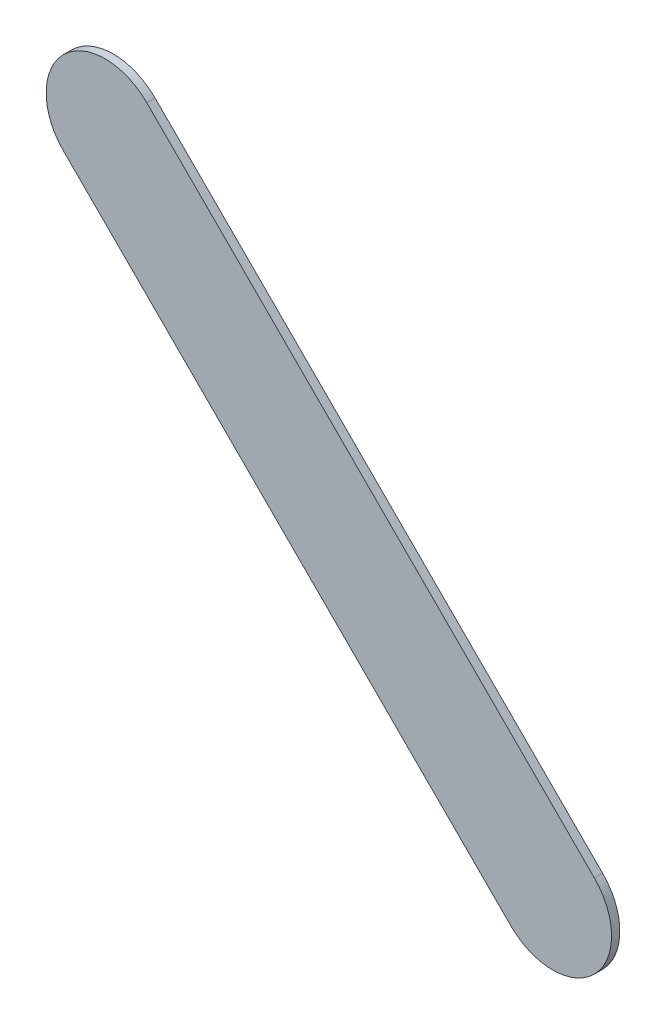
ISO-10303-21;
HEADER;
FILE_DESCRIPTION(('STEP AP214'),'2;1');
FILE_NAME('part.step','',(''),(''),'','','');
FILE_SCHEMA(('AUTOMOTIVE_DESIGN { 1 0 10303 214 1 1 1 1 }'));
ENDSEC;
DATA;
#1=APPLICATION_CONTEXT('core data for automotive mechanical design processes');
#2=APPLICATION_PROTOCOL_DEFINITION('international standard','automotive_design',2000,#1);
#3=PRODUCT_CONTEXT('',#1,'mechanical');
#4=PRODUCT('Part','Part','',(#3));
#5=PRODUCT_RELATED_PRODUCT_CATEGORY('part','',(#4));
#6=PRODUCT_DEFINITION_FORMATION('','',#4);
#7=PRODUCT_DEFINITION_CONTEXT('part definition',#1,'design');
#8=PRODUCT_DEFINITION('design','',#6,#7);
#9=PRODUCT_DEFINITION_SHAPE('','',#8);
#10=(LENGTH_UNIT() NAMED_UNIT(*) SI_UNIT(.MILLI.,.METRE.));
#11=(NAMED_UNIT(*) PLANE_ANGLE_UNIT() SI_UNIT($,.RADIAN.));
#12=(NAMED_UNIT(*) SI_UNIT($,.STERADIAN.) SOLID_ANGLE_UNIT());
#13=UNCERTAINTY_MEASURE_WITH_UNIT(LENGTH_MEASURE(1.E-05),#10,'distance_accuracy_value','');
#14=(GEOMETRIC_REPRESENTATION_CONTEXT(3) GLOBAL_UNCERTAINTY_ASSIGNED_CONTEXT((#13)) GLOBAL_UNIT_ASSIGNED_CONTEXT((#10,
#11,#12)) REPRESENTATION_CONTEXT('',''));
#15=CARTESIAN_POINT('',(0.,0.,0.));
#16=DIRECTION('',(0.,0.,1.));
#17=DIRECTION('',(1.,0.,0.));
#18=AXIS2_PLACEMENT_3D('',#15,#16,#17);
#19=CARTESIAN_POINT('',(149.020776,-72.333242,0.));
#20=DIRECTION('',(0.,0.,1.));
#21=DIRECTION('',(1.,0.,0.));
#22=AXIS2_PLACEMENT_3D('',#19,#20,#21);
#23=PLANE('',#22);
#24=DIRECTION('',(-0.707106781186548,0.707106781186548,0.));
#25=VECTOR('',#24,1.);
#26=CARTESIAN_POINT('',(149.020776,-72.333242,0.));
#27=LINE('',#26,#25);
#28=CARTESIAN_POINT('',(149.020776,-72.333242,0.));
#29=VERTEX_POINT('',#28);
#30=CARTESIAN_POINT('',(147.122757,-70.435223,0.));
#31=VERTEX_POINT('',#30);
#32=EDGE_CURVE('E85',#29,#31,#27,.T.);
#33=ORIENTED_EDGE('',*,*,#32,.T.);
#34=CARTESIAN_POINT('',(146.9459805,-70.6119995,0.));
#35=DIRECTION('',(0.,0.,1.));
#36=DIRECTION('',(0.707106781186548,0.707106781186548,0.));
#37=AXIS2_PLACEMENT_3D('',#34,#35,#36);
#38=CIRCLE('',#37,0.249999723809);
#39=CARTESIAN_POINT('',(146.769204,-70.788776,0.));
#40=VERTEX_POINT('',#39);
#41=EDGE_CURVE('E72',#31,#40,#38,.T.);
#42=ORIENTED_EDGE('',*,*,#41,.T.);
#43=DIRECTION('',(0.707106781186548,-0.707106781186548,0.));
#44=VECTOR('',#43,1.);
#45=CARTESIAN_POINT('',(146.769204,-70.788776,0.));
#46=LINE('',#45,#44);
#47=CARTESIAN_POINT('',(148.667223,-72.686795,0.));
#48=VERTEX_POINT('',#47);
#49=EDGE_CURVE('E108',#40,#48,#46,.T.);
#50=ORIENTED_EDGE('',*,*,#49,.T.);
#51=CARTESIAN_POINT('',(148.8439995,-72.5100185,0.));
#52=DIRECTION('',(0.,0.,1.));
#53=DIRECTION('',(-0.707106781186548,-0.707106781186548,0.));
#54=AXIS2_PLACEMENT_3D('',#51,#52,#53);
#55=CIRCLE('',#54,0.249999723809);
#56=EDGE_CURVE('E11',#48,#29,#55,.T.);
#57=ORIENTED_EDGE('',*,*,#56,.T.);
#58=EDGE_LOOP('',(#33,#42,#50,#57));
#59=FACE_BOUND('',#58,.T.);
#60=ADVANCED_FACE('F17',(#59),#23,.T.);
#61=CARTESIAN_POINT('',(149.020776,-72.333242,-0.035));
#62=DIRECTION('',(0.,0.,1.));
#63=DIRECTION('',(1.,0.,0.));
#64=AXIS2_PLACEMENT_3D('',#61,#62,#63);
#65=PLANE('',#64);
#66=CARTESIAN_POINT('',(148.8439995,-72.5100185,-0.035));
#67=DIRECTION('',(0.,0.,1.));
#68=DIRECTION('',(-0.707106781186548,-0.707106781186548,0.));
#69=AXIS2_PLACEMENT_3D('',#66,#67,#68);
#70=CIRCLE('',#69,0.249999723809);
#71=CARTESIAN_POINT('',(148.667223,-72.686795,-0.035));
#72=VERTEX_POINT('',#71);
#73=CARTESIAN_POINT('',(149.020776,-72.333242,-0.035));
#74=VERTEX_POINT('',#73);
#75=EDGE_CURVE('E26',#72,#74,#70,.T.);
#76=ORIENTED_EDGE('',*,*,#75,.F.);
#77=DIRECTION('',(0.707106781186548,-0.707106781186548,0.));
#78=VECTOR('',#77,1.);
#79=CARTESIAN_POINT('',(146.769204,-70.788776,-0.035));
#80=LINE('',#79,#78);
#81=CARTESIAN_POINT('',(146.769204,-70.788776,-0.035));
#82=VERTEX_POINT('',#81);
#83=EDGE_CURVE('E20',#82,#72,#80,.T.);
#84=ORIENTED_EDGE('',*,*,#83,.F.);
#85=CARTESIAN_POINT('',(146.9459805,-70.6119995,-0.035));
#86=DIRECTION('',(0.,0.,1.));
#87=DIRECTION('',(0.707106781186548,0.707106781186548,0.));
#88=AXIS2_PLACEMENT_3D('',#85,#86,#87);
#89=CIRCLE('',#88,0.249999723809);
#90=CARTESIAN_POINT('',(147.122757,-70.435223,-0.035));
#91=VERTEX_POINT('',#90);
#92=EDGE_CURVE('E103',#91,#82,#89,.T.);
#93=ORIENTED_EDGE('',*,*,#92,.F.);
#94=DIRECTION('',(-0.707106781186548,0.707106781186548,0.));
#95=VECTOR('',#94,1.);
#96=CARTESIAN_POINT('',(149.020776,-72.333242,-0.035));
#97=LINE('',#96,#95);
#98=EDGE_CURVE('E92',#74,#91,#97,.T.);
#99=ORIENTED_EDGE('',*,*,#98,.F.);
#100=EDGE_LOOP('',(#76,#84,#93,#99));
#101=FACE_BOUND('',#100,.T.);
#102=ADVANCED_FACE('F125',(#101),#65,.F.);
#103=CARTESIAN_POINT('',(148.8439995,-72.5100185,-0.035));
#104=DIRECTION('',(0.,0.,-1.));
#105=DIRECTION('',(-0.707106781186548,-0.707106781186548,0.));
#106=AXIS2_PLACEMENT_3D('',#103,#104,#105);
#107=CYLINDRICAL_SURFACE('',#106,0.249999723809);
#108=ORIENTED_EDGE('',*,*,#75,.T.);
#109=DIRECTION('',(0.,0.,1.));
#110=VECTOR('',#109,1.);
#111=CARTESIAN_POINT('',(149.020776,-72.333242,-0.035));
#112=LINE('',#111,#110);
#113=EDGE_CURVE('E89',#74,#29,#112,.T.);
#114=ORIENTED_EDGE('',*,*,#113,.T.);
#115=ORIENTED_EDGE('',*,*,#56,.F.);
#116=DIRECTION('',(0.,0.,1.));
#117=VECTOR('',#116,1.);
#118=CARTESIAN_POINT('',(148.667223,-72.686795,-0.035));
#119=LINE('',#118,#117);
#120=EDGE_CURVE('E110',#72,#48,#119,.T.);
#121=ORIENTED_EDGE('',*,*,#120,.F.);
#122=EDGE_LOOP('',(#108,#114,#115,#121));
#123=FACE_BOUND('',#122,.T.);
#124=ADVANCED_FACE('F127',(#123),#107,.T.);
#125=CARTESIAN_POINT('',(146.769204,-70.788776,-0.035));
#126=DIRECTION('',(0.707106781186548,0.707106781186548,0.));
#127=DIRECTION('',(0.,0.,-1.));
#128=AXIS2_PLACEMENT_3D('',#125,#126,#127);
#129=PLANE('',#128);
#130=ORIENTED_EDGE('',*,*,#83,.T.);
#131=ORIENTED_EDGE('',*,*,#120,.T.);
#132=ORIENTED_EDGE('',*,*,#49,.F.);
#133=DIRECTION('',(0.,0.,1.));
#134=VECTOR('',#133,1.);
#135=CARTESIAN_POINT('',(146.769204,-70.788776,-0.035));
#136=LINE('',#135,#134);
#137=EDGE_CURVE('E80',#82,#40,#136,.T.);
#138=ORIENTED_EDGE('',*,*,#137,.F.);
#139=EDGE_LOOP('',(#130,#131,#132,#138));
#140=FACE_BOUND('',#139,.T.);
#141=ADVANCED_FACE('F124',(#140),#129,.F.);
#142=CARTESIAN_POINT('',(146.9459805,-70.6119995,-0.035));
#143=DIRECTION('',(0.,0.,-1.));
#144=DIRECTION('',(0.707106781186548,0.707106781186548,0.));
#145=AXIS2_PLACEMENT_3D('',#142,#143,#144);
#146=CYLINDRICAL_SURFACE('',#145,0.249999723809);
#147=ORIENTED_EDGE('',*,*,#92,.T.);
#148=ORIENTED_EDGE('',*,*,#137,.T.);
#149=ORIENTED_EDGE('',*,*,#41,.F.);
#150=DIRECTION('',(0.,0.,1.));
#151=VECTOR('',#150,1.);
#152=CARTESIAN_POINT('',(147.122757,-70.435223,-0.035));
#153=LINE('',#152,#151);
#154=EDGE_CURVE('E77',#91,#31,#153,.T.);
#155=ORIENTED_EDGE('',*,*,#154,.F.);
#156=EDGE_LOOP('',(#147,#148,#149,#155));
#157=FACE_BOUND('',#156,.T.);
#158=ADVANCED_FACE('F75',(#157),#146,.T.);
#159=CARTESIAN_POINT('',(149.020776,-72.333242,-0.035));
#160=DIRECTION('',(-0.707106781186548,-0.707106781186548,0.));
#161=DIRECTION('',(-0.707106781186548,0.707106781186548,0.));
#162=AXIS2_PLACEMENT_3D('',#159,#160,#161);
#163=PLANE('',#162);
#164=ORIENTED_EDGE('',*,*,#98,.T.);
#165=ORIENTED_EDGE('',*,*,#154,.T.);
#166=ORIENTED_EDGE('',*,*,#32,.F.);
#167=ORIENTED_EDGE('',*,*,#113,.F.);
#168=EDGE_LOOP('',(#164,#165,#166,#167));
#169=FACE_BOUND('',#168,.T.);
#170=ADVANCED_FACE('F91',(#169),#163,.F.);
#171=CLOSED_SHELL('',(#60,#102,#124,#141,#158,#170));
#172=MANIFOLD_SOLID_BREP('B1',#171);
#173=ADVANCED_BREP_SHAPE_REPRESENTATION('',(#18,#172),#14);
#174=SHAPE_DEFINITION_REPRESENTATION(#9,#173);
ENDSEC;
END-ISO-10303-21;
